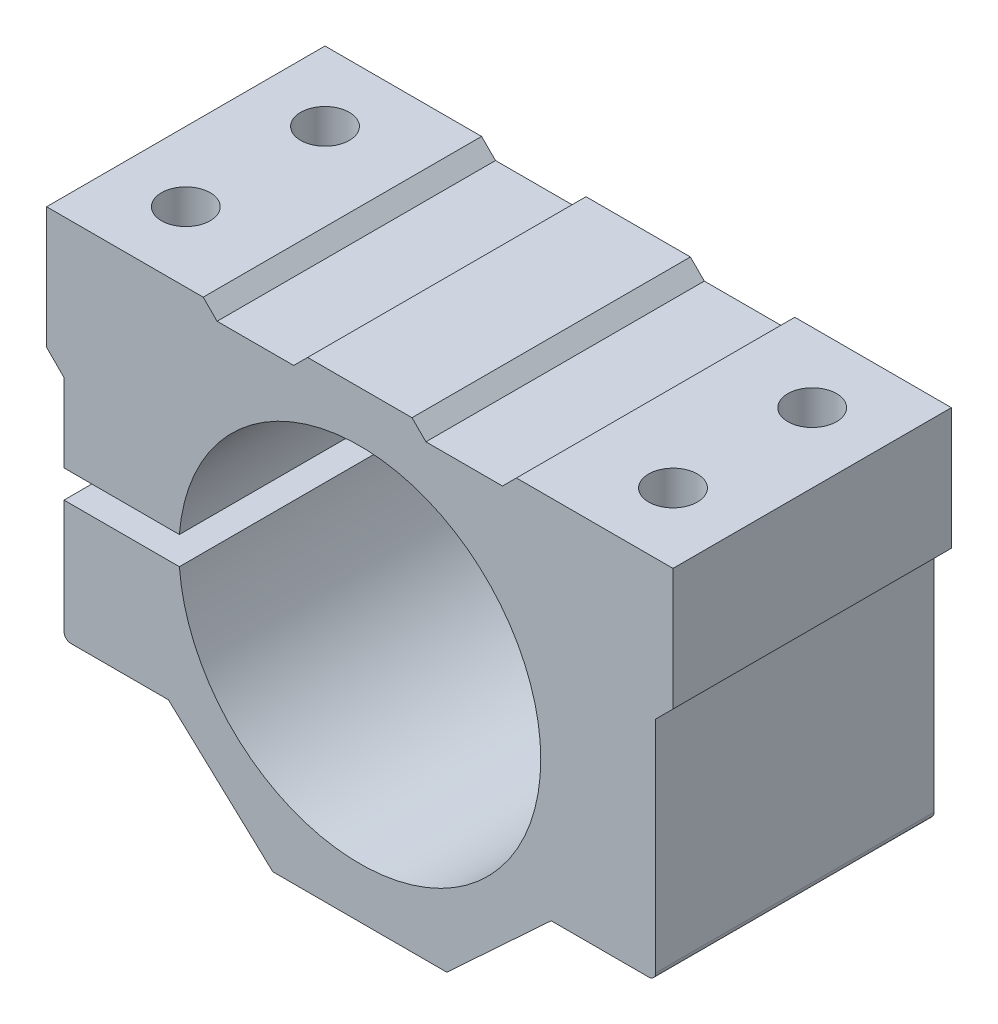
ISO-10303-21;
HEADER;
FILE_DESCRIPTION(('STEP AP214'),'2;1');
FILE_NAME('part.step','',(''),(''),'','','');
FILE_SCHEMA(('AUTOMOTIVE_DESIGN { 1 0 10303 214 1 1 1 1 }'));
ENDSEC;
DATA;
#1=APPLICATION_CONTEXT('core data for automotive mechanical design processes');
#2=APPLICATION_PROTOCOL_DEFINITION('international standard','automotive_design',2000,#1);
#3=PRODUCT_CONTEXT('',#1,'mechanical');
#4=PRODUCT('Part','Part','',(#3));
#5=PRODUCT_RELATED_PRODUCT_CATEGORY('part','',(#4));
#6=PRODUCT_DEFINITION_FORMATION('','',#4);
#7=PRODUCT_DEFINITION_CONTEXT('part definition',#1,'design');
#8=PRODUCT_DEFINITION('design','',#6,#7);
#9=PRODUCT_DEFINITION_SHAPE('','',#8);
#10=(LENGTH_UNIT() NAMED_UNIT(*) SI_UNIT(.MILLI.,.METRE.));
#11=(NAMED_UNIT(*) PLANE_ANGLE_UNIT() SI_UNIT($,.RADIAN.));
#12=(NAMED_UNIT(*) SI_UNIT($,.STERADIAN.) SOLID_ANGLE_UNIT());
#13=UNCERTAINTY_MEASURE_WITH_UNIT(LENGTH_MEASURE(1.E-05),#10,'distance_accuracy_value','');
#14=(GEOMETRIC_REPRESENTATION_CONTEXT(3) GLOBAL_UNCERTAINTY_ASSIGNED_CONTEXT((#13)) GLOBAL_UNIT_ASSIGNED_CONTEXT((#10,
#11,#12)) REPRESENTATION_CONTEXT('',''));
#15=CARTESIAN_POINT('',(0.,0.,0.));
#16=DIRECTION('',(0.,0.,1.));
#17=DIRECTION('',(1.,0.,0.));
#18=AXIS2_PLACEMENT_3D('',#15,#16,#17);
#19=CARTESIAN_POINT('',(0.,0.,40.));
#20=DIRECTION('',(0.,0.,-1.));
#21=DIRECTION('',(-1.,0.,0.));
#22=AXIS2_PLACEMENT_3D('',#19,#20,#21);
#23=PLANE('',#22);
#24=DIRECTION('',(1.,0.,0.));
#25=VECTOR('',#24,1.);
#26=CARTESIAN_POINT('',(42.5,-19.35,40.));
#27=LINE('',#26,#25);
#28=CARTESIAN_POINT('',(27.5,-19.35,40.));
#29=VERTEX_POINT('',#28);
#30=CARTESIAN_POINT('',(41.5,-19.35,40.));
#31=VERTEX_POINT('',#30);
#32=EDGE_CURVE('E381',#29,#31,#27,.T.);
#33=ORIENTED_EDGE('',*,*,#32,.T.);
#34=CARTESIAN_POINT('',(41.5,-18.35,40.));
#35=DIRECTION('',(0.,0.,-1.));
#36=DIRECTION('',(-1.,0.,0.));
#37=AXIS2_PLACEMENT_3D('',#34,#35,#36);
#38=CIRCLE('',#37,1.);
#39=CARTESIAN_POINT('',(42.5,-18.35,40.));
#40=VERTEX_POINT('',#39);
#41=EDGE_CURVE('E355',#31,#40,#38,.F.);
#42=ORIENTED_EDGE('',*,*,#41,.T.);
#43=DIRECTION('',(0.,1.,0.));
#44=VECTOR('',#43,1.);
#45=CARTESIAN_POINT('',(42.5,13.25,40.));
#46=LINE('',#45,#44);
#47=CARTESIAN_POINT('',(42.5,13.25,40.));
#48=VERTEX_POINT('',#47);
#49=EDGE_CURVE('E388',#40,#48,#46,.T.);
#50=ORIENTED_EDGE('',*,*,#49,.T.);
#51=DIRECTION('',(0.70710678118655,0.707106781186545,0.));
#52=VECTOR('',#51,1.);
#53=CARTESIAN_POINT('',(45.,15.75,40.));
#54=LINE('',#53,#52);
#55=CARTESIAN_POINT('',(45.,15.75,40.));
#56=VERTEX_POINT('',#55);
#57=EDGE_CURVE('E390',#48,#56,#54,.T.);
#58=ORIENTED_EDGE('',*,*,#57,.T.);
#59=DIRECTION('',(0.,1.,0.));
#60=VECTOR('',#59,1.);
#61=CARTESIAN_POINT('',(45.,33.25,40.));
#62=LINE('',#61,#60);
#63=CARTESIAN_POINT('',(45.,33.25,40.));
#64=VERTEX_POINT('',#63);
#65=EDGE_CURVE('E392',#56,#64,#62,.T.);
#66=ORIENTED_EDGE('',*,*,#65,.T.);
#67=DIRECTION('',(-1.,0.,0.));
#68=VECTOR('',#67,1.);
#69=CARTESIAN_POINT('',(45.,33.25,40.));
#70=LINE('',#69,#68);
#71=CARTESIAN_POINT('',(22.5,33.25,40.));
#72=VERTEX_POINT('',#71);
#73=EDGE_CURVE('E394',#64,#72,#70,.T.);
#74=ORIENTED_EDGE('',*,*,#73,.T.);
#75=DIRECTION('',(-0.707106781186549,-0.707106781186546,0.));
#76=VECTOR('',#75,1.);
#77=CARTESIAN_POINT('',(22.5,33.25,40.));
#78=LINE('',#77,#76);
#79=CARTESIAN_POINT('',(20.5,31.25,40.));
#80=VERTEX_POINT('',#79);
#81=EDGE_CURVE('E396',#72,#80,#78,.T.);
#82=ORIENTED_EDGE('',*,*,#81,.T.);
#83=DIRECTION('',(-1.,0.,0.));
#84=VECTOR('',#83,1.);
#85=CARTESIAN_POINT('',(20.5,31.25,40.));
#86=LINE('',#85,#84);
#87=CARTESIAN_POINT('',(9.49999999999999,31.25,40.));
#88=VERTEX_POINT('',#87);
#89=EDGE_CURVE('E398',#80,#88,#86,.T.);
#90=ORIENTED_EDGE('',*,*,#89,.T.);
#91=DIRECTION('',(-0.707106781186546,0.707106781186549,0.));
#92=VECTOR('',#91,1.);
#93=CARTESIAN_POINT('',(9.49999999999999,31.25,40.));
#94=LINE('',#93,#92);
#95=CARTESIAN_POINT('',(7.5,33.25,40.));
#96=VERTEX_POINT('',#95);
#97=EDGE_CURVE('E400',#88,#96,#94,.T.);
#98=ORIENTED_EDGE('',*,*,#97,.T.);
#99=DIRECTION('',(-1.,0.,0.));
#100=VECTOR('',#99,1.);
#101=CARTESIAN_POINT('',(-7.5,33.25,40.));
#102=LINE('',#101,#100);
#103=CARTESIAN_POINT('',(-7.5,33.25,40.));
#104=VERTEX_POINT('',#103);
#105=EDGE_CURVE('E402',#96,#104,#102,.T.);
#106=ORIENTED_EDGE('',*,*,#105,.T.);
#107=DIRECTION('',(-0.707106781186546,-0.707106781186549,0.));
#108=VECTOR('',#107,1.);
#109=CARTESIAN_POINT('',(-9.49999999999999,31.25,40.));
#110=LINE('',#109,#108);
#111=CARTESIAN_POINT('',(-9.49999999999999,31.25,40.));
#112=VERTEX_POINT('',#111);
#113=EDGE_CURVE('E404',#104,#112,#110,.T.);
#114=ORIENTED_EDGE('',*,*,#113,.T.);
#115=DIRECTION('',(-1.,0.,0.));
#116=VECTOR('',#115,1.);
#117=CARTESIAN_POINT('',(-20.5,31.25,40.));
#118=LINE('',#117,#116);
#119=CARTESIAN_POINT('',(-20.5,31.25,40.));
#120=VERTEX_POINT('',#119);
#121=EDGE_CURVE('E406',#112,#120,#118,.T.);
#122=ORIENTED_EDGE('',*,*,#121,.T.);
#123=DIRECTION('',(-0.707106781186549,0.707106781186546,0.));
#124=VECTOR('',#123,1.);
#125=CARTESIAN_POINT('',(-22.5,33.25,40.));
#126=LINE('',#125,#124);
#127=CARTESIAN_POINT('',(-22.5,33.25,40.));
#128=VERTEX_POINT('',#127);
#129=EDGE_CURVE('E281',#120,#128,#126,.T.);
#130=ORIENTED_EDGE('',*,*,#129,.T.);
#131=DIRECTION('',(-1.,0.,0.));
#132=VECTOR('',#131,1.);
#133=CARTESIAN_POINT('',(-45.,33.25,40.));
#134=LINE('',#133,#132);
#135=CARTESIAN_POINT('',(-45.,33.25,40.));
#136=VERTEX_POINT('',#135);
#137=EDGE_CURVE('E276',#128,#136,#134,.T.);
#138=ORIENTED_EDGE('',*,*,#137,.T.);
#139=DIRECTION('',(0.,-1.,0.));
#140=VECTOR('',#139,1.);
#141=CARTESIAN_POINT('',(-45.,33.25,40.));
#142=LINE('',#141,#140);
#143=CARTESIAN_POINT('',(-45.,15.75,40.));
#144=VERTEX_POINT('',#143);
#145=EDGE_CURVE('E422',#136,#144,#142,.T.);
#146=ORIENTED_EDGE('',*,*,#145,.T.);
#147=DIRECTION('',(0.70710678118655,-0.707106781186545,0.));
#148=VECTOR('',#147,1.);
#149=CARTESIAN_POINT('',(-45.,15.75,40.));
#150=LINE('',#149,#148);
#151=CARTESIAN_POINT('',(-42.5,13.25,40.));
#152=VERTEX_POINT('',#151);
#153=EDGE_CURVE('E796',#144,#152,#150,.T.);
#154=ORIENTED_EDGE('',*,*,#153,.T.);
#155=DIRECTION('',(0.,-1.,0.));
#156=VECTOR('',#155,1.);
#157=CARTESIAN_POINT('',(-42.5,13.25,40.));
#158=LINE('',#157,#156);
#159=CARTESIAN_POINT('',(-42.5,2.,40.));
#160=VERTEX_POINT('',#159);
#161=EDGE_CURVE('E799',#152,#160,#158,.T.);
#162=ORIENTED_EDGE('',*,*,#161,.T.);
#163=DIRECTION('',(-1.,0.,0.));
#164=VECTOR('',#163,1.);
#165=CARTESIAN_POINT('',(-48.6147155122932,2.,40.));
#166=LINE('',#165,#164);
#167=CARTESIAN_POINT('',(-25.9229627936314,2.,40.));
#168=VERTEX_POINT('',#167);
#169=EDGE_CURVE('E212',#168,#160,#166,.T.);
#170=ORIENTED_EDGE('',*,*,#169,.F.);
#171=CARTESIAN_POINT('',(0.,0.,40.));
#172=DIRECTION('',(0.,0.,1.));
#173=DIRECTION('',(1.,0.,0.));
#174=AXIS2_PLACEMENT_3D('',#171,#172,#173);
#175=CIRCLE('',#174,26.);
#176=CARTESIAN_POINT('',(-25.9229627936314,-2.,40.));
#177=VERTEX_POINT('',#176);
#178=EDGE_CURVE('E412',#177,#168,#175,.T.);
#179=ORIENTED_EDGE('',*,*,#178,.F.);
#180=DIRECTION('',(1.,0.,0.));
#181=VECTOR('',#180,1.);
#182=CARTESIAN_POINT('',(-48.6147155122932,-2.,40.));
#183=LINE('',#182,#181);
#184=CARTESIAN_POINT('',(-42.5,-2.,40.));
#185=VERTEX_POINT('',#184);
#186=EDGE_CURVE('E230',#185,#177,#183,.T.);
#187=ORIENTED_EDGE('',*,*,#186,.F.);
#188=CARTESIAN_POINT('',(-42.5,-18.35,40.));
#189=VERTEX_POINT('',#188);
#190=EDGE_CURVE('E798',#185,#189,#158,.T.);
#191=ORIENTED_EDGE('',*,*,#190,.T.);
#192=CARTESIAN_POINT('',(-41.5,-18.35,40.));
#193=DIRECTION('',(0.,0.,-1.));
#194=DIRECTION('',(-1.,0.,0.));
#195=AXIS2_PLACEMENT_3D('',#192,#193,#194);
#196=CIRCLE('',#195,1.);
#197=CARTESIAN_POINT('',(-41.5,-19.35,40.));
#198=VERTEX_POINT('',#197);
#199=EDGE_CURVE('E49',#189,#198,#196,.F.);
#200=ORIENTED_EDGE('',*,*,#199,.T.);
#201=DIRECTION('',(1.,0.,0.));
#202=VECTOR('',#201,1.);
#203=CARTESIAN_POINT('',(-42.5,-19.35,40.));
#204=LINE('',#203,#202);
#205=CARTESIAN_POINT('',(-27.5,-19.35,40.));
#206=VERTEX_POINT('',#205);
#207=EDGE_CURVE('E362',#198,#206,#204,.T.);
#208=ORIENTED_EDGE('',*,*,#207,.T.);
#209=DIRECTION('',(0.733489755383455,-0.679700506655336,0.));
#210=VECTOR('',#209,1.);
#211=CARTESIAN_POINT('',(-27.5,-19.35,40.));
#212=LINE('',#211,#210);
#213=CARTESIAN_POINT('',(-12.5,-33.25,40.));
#214=VERTEX_POINT('',#213);
#215=EDGE_CURVE('E379',#206,#214,#212,.T.);
#216=ORIENTED_EDGE('',*,*,#215,.T.);
#217=DIRECTION('',(1.,0.,0.));
#218=VECTOR('',#217,1.);
#219=CARTESIAN_POINT('',(-12.5,-33.25,40.));
#220=LINE('',#219,#218);
#221=CARTESIAN_POINT('',(12.5,-33.25,40.));
#222=VERTEX_POINT('',#221);
#223=EDGE_CURVE('E376',#214,#222,#220,.T.);
#224=ORIENTED_EDGE('',*,*,#223,.T.);
#225=DIRECTION('',(0.733489755383455,0.679700506655336,0.));
#226=VECTOR('',#225,1.);
#227=CARTESIAN_POINT('',(27.5,-19.35,40.));
#228=LINE('',#227,#226);
#229=EDGE_CURVE('E378',#222,#29,#228,.T.);
#230=ORIENTED_EDGE('',*,*,#229,.T.);
#231=EDGE_LOOP('',(#33,#42,#50,#58,#66,#74,#82,#90,#98,#106,#114,#122,#130,#138,#146,#154,#162,
#170,#179,#187,#191,#200,#208,#216,#224,#230));
#232=FACE_BOUND('',#231,.T.);
#233=ADVANCED_FACE('F34',(#232),#23,.F.);
#234=CARTESIAN_POINT('',(0.,0.,0.));
#235=DIRECTION('',(0.,0.,-1.));
#236=DIRECTION('',(-1.,0.,0.));
#237=AXIS2_PLACEMENT_3D('',#234,#235,#236);
#238=PLANE('',#237);
#239=DIRECTION('',(0.,1.,0.));
#240=VECTOR('',#239,1.);
#241=CARTESIAN_POINT('',(42.5,13.25,0.));
#242=LINE('',#241,#240);
#243=CARTESIAN_POINT('',(42.5,-18.35,0.));
#244=VERTEX_POINT('',#243);
#245=CARTESIAN_POINT('',(42.5,13.25,0.));
#246=VERTEX_POINT('',#245);
#247=EDGE_CURVE('E254',#244,#246,#242,.T.);
#248=ORIENTED_EDGE('',*,*,#247,.F.);
#249=CARTESIAN_POINT('',(41.5,-18.35,0.));
#250=DIRECTION('',(0.,0.,-1.));
#251=DIRECTION('',(-1.,0.,0.));
#252=AXIS2_PLACEMENT_3D('',#249,#250,#251);
#253=CIRCLE('',#252,1.);
#254=CARTESIAN_POINT('',(41.5,-19.35,0.));
#255=VERTEX_POINT('',#254);
#256=EDGE_CURVE('E350',#244,#255,#253,.T.);
#257=ORIENTED_EDGE('',*,*,#256,.T.);
#258=DIRECTION('',(1.,0.,0.));
#259=VECTOR('',#258,1.);
#260=CARTESIAN_POINT('',(42.5,-19.35,0.));
#261=LINE('',#260,#259);
#262=CARTESIAN_POINT('',(27.5,-19.35,0.));
#263=VERTEX_POINT('',#262);
#264=EDGE_CURVE('E251',#263,#255,#261,.T.);
#265=ORIENTED_EDGE('',*,*,#264,.F.);
#266=DIRECTION('',(0.733489755383455,0.679700506655336,0.));
#267=VECTOR('',#266,1.);
#268=CARTESIAN_POINT('',(27.5,-19.35,0.));
#269=LINE('',#268,#267);
#270=CARTESIAN_POINT('',(12.5,-33.25,0.));
#271=VERTEX_POINT('',#270);
#272=EDGE_CURVE('E249',#271,#263,#269,.T.);
#273=ORIENTED_EDGE('',*,*,#272,.F.);
#274=DIRECTION('',(1.,0.,0.));
#275=VECTOR('',#274,1.);
#276=CARTESIAN_POINT('',(-12.5,-33.25,0.));
#277=LINE('',#276,#275);
#278=CARTESIAN_POINT('',(-12.5,-33.25,0.));
#279=VERTEX_POINT('',#278);
#280=EDGE_CURVE('E247',#279,#271,#277,.T.);
#281=ORIENTED_EDGE('',*,*,#280,.F.);
#282=DIRECTION('',(0.733489755383455,-0.679700506655336,0.));
#283=VECTOR('',#282,1.);
#284=CARTESIAN_POINT('',(-27.5,-19.35,0.));
#285=LINE('',#284,#283);
#286=CARTESIAN_POINT('',(-27.5,-19.35,0.));
#287=VERTEX_POINT('',#286);
#288=EDGE_CURVE('E240',#287,#279,#285,.T.);
#289=ORIENTED_EDGE('',*,*,#288,.F.);
#290=DIRECTION('',(1.,0.,0.));
#291=VECTOR('',#290,1.);
#292=CARTESIAN_POINT('',(-42.5,-19.35,0.));
#293=LINE('',#292,#291);
#294=CARTESIAN_POINT('',(-41.5,-19.35,0.));
#295=VERTEX_POINT('',#294);
#296=EDGE_CURVE('E237',#295,#287,#293,.T.);
#297=ORIENTED_EDGE('',*,*,#296,.F.);
#298=CARTESIAN_POINT('',(-41.5,-18.35,0.));
#299=DIRECTION('',(0.,0.,-1.));
#300=DIRECTION('',(-1.,0.,0.));
#301=AXIS2_PLACEMENT_3D('',#298,#299,#300);
#302=CIRCLE('',#301,1.);
#303=CARTESIAN_POINT('',(-42.5,-18.35,0.));
#304=VERTEX_POINT('',#303);
#305=EDGE_CURVE('E348',#295,#304,#302,.T.);
#306=ORIENTED_EDGE('',*,*,#305,.T.);
#307=DIRECTION('',(0.,-1.,0.));
#308=VECTOR('',#307,1.);
#309=CARTESIAN_POINT('',(-42.5,13.25,0.));
#310=LINE('',#309,#308);
#311=CARTESIAN_POINT('',(-42.5,-2.,0.));
#312=VERTEX_POINT('',#311);
#313=EDGE_CURVE('E238',#312,#304,#310,.T.);
#314=ORIENTED_EDGE('',*,*,#313,.F.);
#315=DIRECTION('',(1.,0.,0.));
#316=VECTOR('',#315,1.);
#317=CARTESIAN_POINT('',(-48.6147155122932,-2.,0.));
#318=LINE('',#317,#316);
#319=CARTESIAN_POINT('',(-25.9229627936314,-2.,0.));
#320=VERTEX_POINT('',#319);
#321=EDGE_CURVE('E231',#312,#320,#318,.T.);
#322=ORIENTED_EDGE('',*,*,#321,.T.);
#323=CARTESIAN_POINT('',(0.,0.,0.));
#324=DIRECTION('',(0.,0.,1.));
#325=DIRECTION('',(1.,0.,0.));
#326=AXIS2_PLACEMENT_3D('',#323,#324,#325);
#327=CIRCLE('',#326,26.);
#328=CARTESIAN_POINT('',(-25.9229627936314,2.,0.));
#329=VERTEX_POINT('',#328);
#330=EDGE_CURVE('E229',#320,#329,#327,.T.);
#331=ORIENTED_EDGE('',*,*,#330,.T.);
#332=DIRECTION('',(-1.,0.,0.));
#333=VECTOR('',#332,1.);
#334=CARTESIAN_POINT('',(-48.6147155122932,2.,0.));
#335=LINE('',#334,#333);
#336=CARTESIAN_POINT('',(-42.5,2.,0.));
#337=VERTEX_POINT('',#336);
#338=EDGE_CURVE('E209',#329,#337,#335,.T.);
#339=ORIENTED_EDGE('',*,*,#338,.T.);
#340=CARTESIAN_POINT('',(-42.5,13.25,0.));
#341=VERTEX_POINT('',#340);
#342=EDGE_CURVE('E226',#341,#337,#310,.T.);
#343=ORIENTED_EDGE('',*,*,#342,.F.);
#344=DIRECTION('',(0.70710678118655,-0.707106781186545,0.));
#345=VECTOR('',#344,1.);
#346=CARTESIAN_POINT('',(-45.,15.75,0.));
#347=LINE('',#346,#345);
#348=CARTESIAN_POINT('',(-45.,15.75,0.));
#349=VERTEX_POINT('',#348);
#350=EDGE_CURVE('E242',#349,#341,#347,.T.);
#351=ORIENTED_EDGE('',*,*,#350,.F.);
#352=DIRECTION('',(0.,-1.,0.));
#353=VECTOR('',#352,1.);
#354=CARTESIAN_POINT('',(-45.,33.25,0.));
#355=LINE('',#354,#353);
#356=CARTESIAN_POINT('',(-45.,33.25,0.));
#357=VERTEX_POINT('',#356);
#358=EDGE_CURVE('E411',#357,#349,#355,.T.);
#359=ORIENTED_EDGE('',*,*,#358,.F.);
#360=DIRECTION('',(-1.,0.,0.));
#361=VECTOR('',#360,1.);
#362=CARTESIAN_POINT('',(-45.,33.25,0.));
#363=LINE('',#362,#361);
#364=CARTESIAN_POINT('',(-22.5,33.25,0.));
#365=VERTEX_POINT('',#364);
#366=EDGE_CURVE('E409',#365,#357,#363,.T.);
#367=ORIENTED_EDGE('',*,*,#366,.F.);
#368=DIRECTION('',(-0.707106781186549,0.707106781186546,0.));
#369=VECTOR('',#368,1.);
#370=CARTESIAN_POINT('',(-22.5,33.25,0.));
#371=LINE('',#370,#369);
#372=CARTESIAN_POINT('',(-20.5,31.25,0.));
#373=VERTEX_POINT('',#372);
#374=EDGE_CURVE('E274',#373,#365,#371,.T.);
#375=ORIENTED_EDGE('',*,*,#374,.F.);
#376=DIRECTION('',(-1.,0.,0.));
#377=VECTOR('',#376,1.);
#378=CARTESIAN_POINT('',(-20.5,31.25,0.));
#379=LINE('',#378,#377);
#380=CARTESIAN_POINT('',(-9.49999999999999,31.25,0.));
#381=VERTEX_POINT('',#380);
#382=EDGE_CURVE('E272',#381,#373,#379,.T.);
#383=ORIENTED_EDGE('',*,*,#382,.F.);
#384=DIRECTION('',(-0.707106781186546,-0.707106781186549,0.));
#385=VECTOR('',#384,1.);
#386=CARTESIAN_POINT('',(-9.49999999999999,31.25,0.));
#387=LINE('',#386,#385);
#388=CARTESIAN_POINT('',(-7.5,33.25,0.));
#389=VERTEX_POINT('',#388);
#390=EDGE_CURVE('E270',#389,#381,#387,.T.);
#391=ORIENTED_EDGE('',*,*,#390,.F.);
#392=DIRECTION('',(-1.,0.,0.));
#393=VECTOR('',#392,1.);
#394=CARTESIAN_POINT('',(-7.5,33.25,0.));
#395=LINE('',#394,#393);
#396=CARTESIAN_POINT('',(7.5,33.25,0.));
#397=VERTEX_POINT('',#396);
#398=EDGE_CURVE('E268',#397,#389,#395,.T.);
#399=ORIENTED_EDGE('',*,*,#398,.F.);
#400=DIRECTION('',(-0.707106781186546,0.707106781186549,0.));
#401=VECTOR('',#400,1.);
#402=CARTESIAN_POINT('',(9.49999999999999,31.25,0.));
#403=LINE('',#402,#401);
#404=CARTESIAN_POINT('',(9.49999999999999,31.25,0.));
#405=VERTEX_POINT('',#404);
#406=EDGE_CURVE('E266',#405,#397,#403,.T.);
#407=ORIENTED_EDGE('',*,*,#406,.F.);
#408=DIRECTION('',(-1.,0.,0.));
#409=VECTOR('',#408,1.);
#410=CARTESIAN_POINT('',(20.5,31.25,0.));
#411=LINE('',#410,#409);
#412=CARTESIAN_POINT('',(20.5,31.25,0.));
#413=VERTEX_POINT('',#412);
#414=EDGE_CURVE('E264',#413,#405,#411,.T.);
#415=ORIENTED_EDGE('',*,*,#414,.F.);
#416=DIRECTION('',(-0.707106781186549,-0.707106781186546,0.));
#417=VECTOR('',#416,1.);
#418=CARTESIAN_POINT('',(22.5,33.25,0.));
#419=LINE('',#418,#417);
#420=CARTESIAN_POINT('',(22.5,33.25,0.));
#421=VERTEX_POINT('',#420);
#422=EDGE_CURVE('E262',#421,#413,#419,.T.);
#423=ORIENTED_EDGE('',*,*,#422,.F.);
#424=DIRECTION('',(-1.,0.,0.));
#425=VECTOR('',#424,1.);
#426=CARTESIAN_POINT('',(45.,33.25,0.));
#427=LINE('',#426,#425);
#428=CARTESIAN_POINT('',(45.,33.25,0.));
#429=VERTEX_POINT('',#428);
#430=EDGE_CURVE('E260',#429,#421,#427,.T.);
#431=ORIENTED_EDGE('',*,*,#430,.F.);
#432=DIRECTION('',(0.,1.,0.));
#433=VECTOR('',#432,1.);
#434=CARTESIAN_POINT('',(45.,33.25,0.));
#435=LINE('',#434,#433);
#436=CARTESIAN_POINT('',(45.,15.75,0.));
#437=VERTEX_POINT('',#436);
#438=EDGE_CURVE('E258',#437,#429,#435,.T.);
#439=ORIENTED_EDGE('',*,*,#438,.F.);
#440=DIRECTION('',(0.70710678118655,0.707106781186545,0.));
#441=VECTOR('',#440,1.);
#442=CARTESIAN_POINT('',(45.,15.75,0.));
#443=LINE('',#442,#441);
#444=EDGE_CURVE('E256',#246,#437,#443,.T.);
#445=ORIENTED_EDGE('',*,*,#444,.F.);
#446=EDGE_LOOP('',(#248,#257,#265,#273,#281,#289,#297,#306,#314,#322,#331,#339,#343,#351,#359,
#367,#375,#383,#391,#399,#407,#415,#423,#431,#439,#445));
#447=FACE_BOUND('',#446,.T.);
#448=ADVANCED_FACE('F224',(#447),#238,.T.);
#449=CARTESIAN_POINT('',(-42.5,13.25,40.));
#450=DIRECTION('',(1.,0.,0.));
#451=DIRECTION('',(0.,1.,0.));
#452=AXIS2_PLACEMENT_3D('',#449,#450,#451);
#453=PLANE('',#452);
#454=ORIENTED_EDGE('',*,*,#313,.T.);
#455=DIRECTION('',(0.,0.,-1.));
#456=VECTOR('',#455,1.);
#457=CARTESIAN_POINT('',(-42.5,-18.35,40.));
#458=LINE('',#457,#456);
#459=EDGE_CURVE('E11',#304,#189,#458,.F.);
#460=ORIENTED_EDGE('',*,*,#459,.T.);
#461=ORIENTED_EDGE('',*,*,#190,.F.);
#462=DIRECTION('',(0.,0.,1.));
#463=VECTOR('',#462,1.);
#464=CARTESIAN_POINT('',(-42.5,-2.,40.));
#465=LINE('',#464,#463);
#466=EDGE_CURVE('E803',#312,#185,#465,.T.);
#467=ORIENTED_EDGE('',*,*,#466,.F.);
#468=EDGE_LOOP('',(#454,#460,#461,#467));
#469=FACE_BOUND('',#468,.T.);
#470=ADVANCED_FACE('F506',(#469),#453,.F.);
#471=DIRECTION('',(0.,0.,-1.));
#472=VECTOR('',#471,1.);
#473=CARTESIAN_POINT('',(-42.5,2.,40.));
#474=LINE('',#473,#472);
#475=EDGE_CURVE('E206',#160,#337,#474,.T.);
#476=ORIENTED_EDGE('',*,*,#475,.F.);
#477=ORIENTED_EDGE('',*,*,#161,.F.);
#478=DIRECTION('',(0.,0.,-1.));
#479=VECTOR('',#478,1.);
#480=CARTESIAN_POINT('',(-42.5,13.25,40.));
#481=LINE('',#480,#479);
#482=EDGE_CURVE('E236',#152,#341,#481,.T.);
#483=ORIENTED_EDGE('',*,*,#482,.T.);
#484=ORIENTED_EDGE('',*,*,#342,.T.);
#485=EDGE_LOOP('',(#476,#477,#483,#484));
#486=FACE_BOUND('',#485,.T.);
#487=ADVANCED_FACE('F234',(#486),#453,.F.);
#488=CARTESIAN_POINT('',(0.,0.,40.));
#489=DIRECTION('',(0.,0.,-1.));
#490=DIRECTION('',(-1.,0.,0.));
#491=AXIS2_PLACEMENT_3D('',#488,#489,#490);
#492=CYLINDRICAL_SURFACE('',#491,26.);
#493=ORIENTED_EDGE('',*,*,#330,.F.);
#494=DIRECTION('',(0.,0.,-1.));
#495=VECTOR('',#494,1.);
#496=CARTESIAN_POINT('',(-25.9229627936314,-2.,40.));
#497=LINE('',#496,#495);
#498=EDGE_CURVE('E806',#320,#177,#497,.F.);
#499=ORIENTED_EDGE('',*,*,#498,.T.);
#500=ORIENTED_EDGE('',*,*,#178,.T.);
#501=DIRECTION('',(0.,0.,-1.));
#502=VECTOR('',#501,1.);
#503=CARTESIAN_POINT('',(-25.9229627936314,2.,40.));
#504=LINE('',#503,#502);
#505=EDGE_CURVE('E218',#168,#329,#504,.T.);
#506=ORIENTED_EDGE('',*,*,#505,.T.);
#507=EDGE_LOOP('',(#493,#499,#500,#506));
#508=FACE_BOUND('',#507,.T.);
#509=ADVANCED_FACE('F509',(#508),#492,.F.);
#510=CARTESIAN_POINT('',(-35.,-33.25,10.));
#511=DIRECTION('',(0.,1.,0.));
#512=DIRECTION('',(0.,0.,1.));
#513=AXIS2_PLACEMENT_3D('',#510,#511,#512);
#514=CYLINDRICAL_SURFACE('',#513,3.5);
#515=CARTESIAN_POINT('',(-35.,-19.35,10.));
#516=DIRECTION('',(0.,1.,0.));
#517=DIRECTION('',(-1.,0.,0.));
#518=AXIS2_PLACEMENT_3D('',#515,#516,#517);
#519=CIRCLE('',#518,3.5);
#520=CARTESIAN_POINT('',(-38.5,-19.35,10.));
#521=VERTEX_POINT('',#520);
#522=EDGE_CURVE('E331',#521,#521,#519,.T.);
#523=ORIENTED_EDGE('',*,*,#522,.F.);
#524=EDGE_LOOP('',(#523));
#525=FACE_BOUND('',#524,.T.);
#526=CARTESIAN_POINT('',(-35.,-2.,10.));
#527=DIRECTION('',(0.,1.,0.));
#528=DIRECTION('',(-1.,0.,0.));
#529=AXIS2_PLACEMENT_3D('',#526,#527,#528);
#530=CIRCLE('',#529,3.5);
#531=CARTESIAN_POINT('',(-38.5,-2.,10.));
#532=VERTEX_POINT('',#531);
#533=EDGE_CURVE('E345',#532,#532,#530,.F.);
#534=ORIENTED_EDGE('',*,*,#533,.F.);
#535=EDGE_LOOP('',(#534));
#536=FACE_BOUND('',#535,.T.);
#537=ADVANCED_FACE('F660',(#525,#536),#514,.F.);
#538=CARTESIAN_POINT('',(-35.,33.25,10.));
#539=DIRECTION('',(0.,1.,0.));
#540=DIRECTION('',(0.,0.,1.));
#541=AXIS2_PLACEMENT_3D('',#538,#539,#540);
#542=CIRCLE('',#541,3.5);
#543=CARTESIAN_POINT('',(-35.,33.25,13.5));
#544=VERTEX_POINT('',#543);
#545=EDGE_CURVE('E334',#544,#544,#542,.T.);
#546=ORIENTED_EDGE('',*,*,#545,.T.);
#547=EDGE_LOOP('',(#546));
#548=FACE_BOUND('',#547,.T.);
#549=CARTESIAN_POINT('',(-35.,2.,10.));
#550=DIRECTION('',(0.,-1.,0.));
#551=DIRECTION('',(0.,0.,-1.));
#552=AXIS2_PLACEMENT_3D('',#549,#550,#551);
#553=CIRCLE('',#552,3.5);
#554=CARTESIAN_POINT('',(-35.,2.,6.5));
#555=VERTEX_POINT('',#554);
#556=EDGE_CURVE('E342',#555,#555,#553,.F.);
#557=ORIENTED_EDGE('',*,*,#556,.F.);
#558=EDGE_LOOP('',(#557));
#559=FACE_BOUND('',#558,.T.);
#560=ADVANCED_FACE('F668',(#548,#559),#514,.F.);
#561=CARTESIAN_POINT('',(-35.,-33.25,30.));
#562=DIRECTION('',(0.,1.,0.));
#563=DIRECTION('',(0.,0.,1.));
#564=AXIS2_PLACEMENT_3D('',#561,#562,#563);
#565=CYLINDRICAL_SURFACE('',#564,3.5);
#566=CARTESIAN_POINT('',(-35.,-19.35,30.));
#567=DIRECTION('',(0.,1.,0.));
#568=DIRECTION('',(-1.,0.,0.));
#569=AXIS2_PLACEMENT_3D('',#566,#567,#568);
#570=CIRCLE('',#569,3.5);
#571=CARTESIAN_POINT('',(-38.5,-19.35,30.));
#572=VERTEX_POINT('',#571);
#573=EDGE_CURVE('E335',#572,#572,#570,.T.);
#574=ORIENTED_EDGE('',*,*,#573,.F.);
#575=EDGE_LOOP('',(#574));
#576=FACE_BOUND('',#575,.T.);
#577=CARTESIAN_POINT('',(-35.,-2.,30.));
#578=DIRECTION('',(0.,1.,0.));
#579=DIRECTION('',(-1.,0.,0.));
#580=AXIS2_PLACEMENT_3D('',#577,#578,#579);
#581=CIRCLE('',#580,3.5);
#582=CARTESIAN_POINT('',(-38.5,-2.,30.));
#583=VERTEX_POINT('',#582);
#584=EDGE_CURVE('E217',#583,#583,#581,.F.);
#585=ORIENTED_EDGE('',*,*,#584,.F.);
#586=EDGE_LOOP('',(#585));
#587=FACE_BOUND('',#586,.T.);
#588=ADVANCED_FACE('F676',(#576,#587),#565,.F.);
#589=CARTESIAN_POINT('',(-35.,33.25,30.));
#590=DIRECTION('',(0.,1.,0.));
#591=DIRECTION('',(0.,0.,-1.));
#592=AXIS2_PLACEMENT_3D('',#589,#590,#591);
#593=CIRCLE('',#592,3.5);
#594=CARTESIAN_POINT('',(-35.,33.25,26.5));
#595=VERTEX_POINT('',#594);
#596=EDGE_CURVE('E784',#595,#595,#593,.T.);
#597=ORIENTED_EDGE('',*,*,#596,.T.);
#598=EDGE_LOOP('',(#597));
#599=FACE_BOUND('',#598,.T.);
#600=CARTESIAN_POINT('',(-35.,2.,30.));
#601=DIRECTION('',(0.,-1.,0.));
#602=DIRECTION('',(0.,0.,-1.));
#603=AXIS2_PLACEMENT_3D('',#600,#601,#602);
#604=CIRCLE('',#603,3.5);
#605=CARTESIAN_POINT('',(-35.,2.,26.5));
#606=VERTEX_POINT('',#605);
#607=EDGE_CURVE('E339',#606,#606,#604,.F.);
#608=ORIENTED_EDGE('',*,*,#607,.F.);
#609=EDGE_LOOP('',(#608));
#610=FACE_BOUND('',#609,.T.);
#611=ADVANCED_FACE('F684',(#599,#610),#565,.F.);
#612=CARTESIAN_POINT('',(-45.,33.25,40.));
#613=DIRECTION('',(0.,-1.,0.));
#614=DIRECTION('',(0.,0.,-1.));
#615=AXIS2_PLACEMENT_3D('',#612,#613,#614);
#616=PLANE('',#615);
#617=ORIENTED_EDGE('',*,*,#596,.F.);
#618=EDGE_LOOP('',(#617));
#619=FACE_BOUND('',#618,.T.);
#620=ORIENTED_EDGE('',*,*,#545,.F.);
#621=EDGE_LOOP('',(#620));
#622=FACE_BOUND('',#621,.T.);
#623=ORIENTED_EDGE('',*,*,#366,.T.);
#624=DIRECTION('',(0.,0.,-1.));
#625=VECTOR('',#624,1.);
#626=CARTESIAN_POINT('',(-45.,33.25,40.));
#627=LINE('',#626,#625);
#628=EDGE_CURVE('E327',#136,#357,#627,.T.);
#629=ORIENTED_EDGE('',*,*,#628,.F.);
#630=ORIENTED_EDGE('',*,*,#137,.F.);
#631=DIRECTION('',(0.,0.,-1.));
#632=VECTOR('',#631,1.);
#633=CARTESIAN_POINT('',(-22.5,33.25,40.));
#634=LINE('',#633,#632);
#635=EDGE_CURVE('E277',#128,#365,#634,.T.);
#636=ORIENTED_EDGE('',*,*,#635,.T.);
#637=EDGE_LOOP('',(#623,#629,#630,#636));
#638=FACE_BOUND('',#637,.T.);
#639=ADVANCED_FACE('F426',(#619,#622,#638),#616,.F.);
#640=CARTESIAN_POINT('',(-45.,33.25,40.));
#641=DIRECTION('',(1.,0.,0.));
#642=DIRECTION('',(0.,1.,0.));
#643=AXIS2_PLACEMENT_3D('',#640,#641,#642);
#644=PLANE('',#643);
#645=ORIENTED_EDGE('',*,*,#358,.T.);
#646=DIRECTION('',(0.,0.,-1.));
#647=VECTOR('',#646,1.);
#648=CARTESIAN_POINT('',(-45.,15.75,40.));
#649=LINE('',#648,#647);
#650=EDGE_CURVE('E324',#144,#349,#649,.T.);
#651=ORIENTED_EDGE('',*,*,#650,.F.);
#652=ORIENTED_EDGE('',*,*,#145,.F.);
#653=ORIENTED_EDGE('',*,*,#628,.T.);
#654=EDGE_LOOP('',(#645,#651,#652,#653));
#655=FACE_BOUND('',#654,.T.);
#656=ADVANCED_FACE('F421',(#655),#644,.F.);
#657=CARTESIAN_POINT('',(-45.,15.75,40.));
#658=DIRECTION('',(0.707106781186545,0.70710678118655,0.));
#659=DIRECTION('',(-0.70710678118655,0.707106781186545,0.));
#660=AXIS2_PLACEMENT_3D('',#657,#658,#659);
#661=PLANE('',#660);
#662=ORIENTED_EDGE('',*,*,#350,.T.);
#663=ORIENTED_EDGE('',*,*,#482,.F.);
#664=ORIENTED_EDGE('',*,*,#153,.F.);
#665=ORIENTED_EDGE('',*,*,#650,.T.);
#666=EDGE_LOOP('',(#662,#663,#664,#665));
#667=FACE_BOUND('',#666,.T.);
#668=ADVANCED_FACE('F416',(#667),#661,.F.);
#669=CARTESIAN_POINT('',(-42.5,-19.35,40.));
#670=DIRECTION('',(0.,1.,0.));
#671=DIRECTION('',(-1.,0.,0.));
#672=AXIS2_PLACEMENT_3D('',#669,#670,#671);
#673=PLANE('',#672);
#674=ORIENTED_EDGE('',*,*,#573,.T.);
#675=EDGE_LOOP('',(#674));
#676=FACE_BOUND('',#675,.T.);
#677=ORIENTED_EDGE('',*,*,#522,.T.);
#678=EDGE_LOOP('',(#677));
#679=FACE_BOUND('',#678,.T.);
#680=ORIENTED_EDGE('',*,*,#207,.F.);
#681=DIRECTION('',(0.,0.,-1.));
#682=VECTOR('',#681,1.);
#683=CARTESIAN_POINT('',(-41.5,-19.35,40.));
#684=LINE('',#683,#682);
#685=EDGE_CURVE('E42',#198,#295,#684,.T.);
#686=ORIENTED_EDGE('',*,*,#685,.T.);
#687=ORIENTED_EDGE('',*,*,#296,.T.);
#688=DIRECTION('',(0.,0.,-1.));
#689=VECTOR('',#688,1.);
#690=CARTESIAN_POINT('',(-27.5,-19.35,40.));
#691=LINE('',#690,#689);
#692=EDGE_CURVE('E320',#206,#287,#691,.T.);
#693=ORIENTED_EDGE('',*,*,#692,.F.);
#694=EDGE_LOOP('',(#680,#686,#687,#693));
#695=FACE_BOUND('',#694,.T.);
#696=ADVANCED_FACE('F360',(#676,#679,#695),#673,.F.);
#697=CARTESIAN_POINT('',(-27.5,-19.35,40.));
#698=DIRECTION('',(0.679700506655336,0.733489755383455,0.));
#699=DIRECTION('',(-0.733489755383455,0.679700506655336,0.));
#700=AXIS2_PLACEMENT_3D('',#697,#698,#699);
#701=PLANE('',#700);
#702=ORIENTED_EDGE('',*,*,#288,.T.);
#703=DIRECTION('',(0.,0.,-1.));
#704=VECTOR('',#703,1.);
#705=CARTESIAN_POINT('',(-12.5,-33.25,40.));
#706=LINE('',#705,#704);
#707=EDGE_CURVE('E317',#214,#279,#706,.T.);
#708=ORIENTED_EDGE('',*,*,#707,.F.);
#709=ORIENTED_EDGE('',*,*,#215,.F.);
#710=ORIENTED_EDGE('',*,*,#692,.T.);
#711=EDGE_LOOP('',(#702,#708,#709,#710));
#712=FACE_BOUND('',#711,.T.);
#713=ADVANCED_FACE('F370',(#712),#701,.F.);
#714=CARTESIAN_POINT('',(-12.5,-33.25,40.));
#715=DIRECTION('',(0.,1.,0.));
#716=DIRECTION('',(0.,0.,1.));
#717=AXIS2_PLACEMENT_3D('',#714,#715,#716);
#718=PLANE('',#717);
#719=ORIENTED_EDGE('',*,*,#280,.T.);
#720=DIRECTION('',(0.,0.,-1.));
#721=VECTOR('',#720,1.);
#722=CARTESIAN_POINT('',(12.5,-33.25,40.));
#723=LINE('',#722,#721);
#724=EDGE_CURVE('E314',#222,#271,#723,.T.);
#725=ORIENTED_EDGE('',*,*,#724,.F.);
#726=ORIENTED_EDGE('',*,*,#223,.F.);
#727=ORIENTED_EDGE('',*,*,#707,.T.);
#728=EDGE_LOOP('',(#719,#725,#726,#727));
#729=FACE_BOUND('',#728,.T.);
#730=ADVANCED_FACE('F374',(#729),#718,.F.);
#731=CARTESIAN_POINT('',(27.5,-19.35,40.));
#732=DIRECTION('',(-0.679700506655336,0.733489755383455,0.));
#733=DIRECTION('',(-0.733489755383455,-0.679700506655336,0.));
#734=AXIS2_PLACEMENT_3D('',#731,#732,#733);
#735=PLANE('',#734);
#736=ORIENTED_EDGE('',*,*,#272,.T.);
#737=DIRECTION('',(0.,0.,-1.));
#738=VECTOR('',#737,1.);
#739=CARTESIAN_POINT('',(27.5,-19.35,40.));
#740=LINE('',#739,#738);
#741=EDGE_CURVE('E311',#29,#263,#740,.T.);
#742=ORIENTED_EDGE('',*,*,#741,.F.);
#743=ORIENTED_EDGE('',*,*,#229,.F.);
#744=ORIENTED_EDGE('',*,*,#724,.T.);
#745=EDGE_LOOP('',(#736,#742,#743,#744));
#746=FACE_BOUND('',#745,.T.);
#747=ADVANCED_FACE('F491',(#746),#735,.F.);
#748=CARTESIAN_POINT('',(42.5,-19.35,40.));
#749=DIRECTION('',(0.,1.,0.));
#750=DIRECTION('',(-1.,0.,0.));
#751=AXIS2_PLACEMENT_3D('',#748,#749,#750);
#752=PLANE('',#751);
#753=CARTESIAN_POINT('',(35.,-19.35,30.));
#754=DIRECTION('',(0.,1.,0.));
#755=DIRECTION('',(-1.,0.,0.));
#756=AXIS2_PLACEMENT_3D('',#753,#754,#755);
#757=CIRCLE('',#756,3.5);
#758=CARTESIAN_POINT('',(31.5,-19.35,30.));
#759=VERTEX_POINT('',#758);
#760=EDGE_CURVE('E338',#759,#759,#757,.T.);
#761=ORIENTED_EDGE('',*,*,#760,.T.);
#762=EDGE_LOOP('',(#761));
#763=FACE_BOUND('',#762,.T.);
#764=CARTESIAN_POINT('',(35.,-19.35,10.));
#765=DIRECTION('',(0.,1.,0.));
#766=DIRECTION('',(-1.,0.,0.));
#767=AXIS2_PLACEMENT_3D('',#764,#765,#766);
#768=CIRCLE('',#767,3.5);
#769=CARTESIAN_POINT('',(31.5,-19.35,10.));
#770=VERTEX_POINT('',#769);
#771=EDGE_CURVE('E818',#770,#770,#768,.T.);
#772=ORIENTED_EDGE('',*,*,#771,.T.);
#773=EDGE_LOOP('',(#772));
#774=FACE_BOUND('',#773,.T.);
#775=ORIENTED_EDGE('',*,*,#264,.T.);
#776=DIRECTION('',(0.,0.,-1.));
#777=VECTOR('',#776,1.);
#778=CARTESIAN_POINT('',(41.5,-19.35,40.));
#779=LINE('',#778,#777);
#780=EDGE_CURVE('E352',#255,#31,#779,.F.);
#781=ORIENTED_EDGE('',*,*,#780,.T.);
#782=ORIENTED_EDGE('',*,*,#32,.F.);
#783=ORIENTED_EDGE('',*,*,#741,.T.);
#784=EDGE_LOOP('',(#775,#781,#782,#783));
#785=FACE_BOUND('',#784,.T.);
#786=ADVANCED_FACE('F488',(#763,#774,#785),#752,.F.);
#787=CARTESIAN_POINT('',(42.5,13.25,40.));
#788=DIRECTION('',(-1.,0.,0.));
#789=DIRECTION('',(0.,-1.,0.));
#790=AXIS2_PLACEMENT_3D('',#787,#788,#789);
#791=PLANE('',#790);
#792=ORIENTED_EDGE('',*,*,#49,.F.);
#793=DIRECTION('',(0.,0.,-1.));
#794=VECTOR('',#793,1.);
#795=CARTESIAN_POINT('',(42.5,-18.35,40.));
#796=LINE('',#795,#794);
#797=EDGE_CURVE('E330',#40,#244,#796,.T.);
#798=ORIENTED_EDGE('',*,*,#797,.T.);
#799=ORIENTED_EDGE('',*,*,#247,.T.);
#800=DIRECTION('',(0.,0.,-1.));
#801=VECTOR('',#800,1.);
#802=CARTESIAN_POINT('',(42.5,13.25,40.));
#803=LINE('',#802,#801);
#804=EDGE_CURVE('E308',#48,#246,#803,.T.);
#805=ORIENTED_EDGE('',*,*,#804,.F.);
#806=EDGE_LOOP('',(#792,#798,#799,#805));
#807=FACE_BOUND('',#806,.T.);
#808=ADVANCED_FACE('F480',(#807),#791,.F.);
#809=CARTESIAN_POINT('',(45.,15.75,40.));
#810=DIRECTION('',(-0.707106781186545,0.70710678118655,0.));
#811=DIRECTION('',(-0.70710678118655,-0.707106781186545,0.));
#812=AXIS2_PLACEMENT_3D('',#809,#810,#811);
#813=PLANE('',#812);
#814=ORIENTED_EDGE('',*,*,#444,.T.);
#815=DIRECTION('',(0.,0.,-1.));
#816=VECTOR('',#815,1.);
#817=CARTESIAN_POINT('',(45.,15.75,40.));
#818=LINE('',#817,#816);
#819=EDGE_CURVE('E305',#56,#437,#818,.T.);
#820=ORIENTED_EDGE('',*,*,#819,.F.);
#821=ORIENTED_EDGE('',*,*,#57,.F.);
#822=ORIENTED_EDGE('',*,*,#804,.T.);
#823=EDGE_LOOP('',(#814,#820,#821,#822));
#824=FACE_BOUND('',#823,.T.);
#825=ADVANCED_FACE('F475',(#824),#813,.F.);
#826=CARTESIAN_POINT('',(45.,33.25,40.));
#827=DIRECTION('',(-1.,0.,0.));
#828=DIRECTION('',(0.,-1.,0.));
#829=AXIS2_PLACEMENT_3D('',#826,#827,#828);
#830=PLANE('',#829);
#831=ORIENTED_EDGE('',*,*,#438,.T.);
#832=DIRECTION('',(0.,0.,-1.));
#833=VECTOR('',#832,1.);
#834=CARTESIAN_POINT('',(45.,33.25,40.));
#835=LINE('',#834,#833);
#836=EDGE_CURVE('E302',#64,#429,#835,.T.);
#837=ORIENTED_EDGE('',*,*,#836,.F.);
#838=ORIENTED_EDGE('',*,*,#65,.F.);
#839=ORIENTED_EDGE('',*,*,#819,.T.);
#840=EDGE_LOOP('',(#831,#837,#838,#839));
#841=FACE_BOUND('',#840,.T.);
#842=ADVANCED_FACE('F471',(#841),#830,.F.);
#843=CARTESIAN_POINT('',(45.,33.25,40.));
#844=DIRECTION('',(0.,-1.,0.));
#845=DIRECTION('',(0.,0.,-1.));
#846=AXIS2_PLACEMENT_3D('',#843,#844,#845);
#847=PLANE('',#846);
#848=CARTESIAN_POINT('',(35.,33.25,30.));
#849=DIRECTION('',(0.,1.,0.));
#850=DIRECTION('',(0.,0.,1.));
#851=AXIS2_PLACEMENT_3D('',#848,#849,#850);
#852=CIRCLE('',#851,3.5);
#853=CARTESIAN_POINT('',(35.,33.25,33.5));
#854=VERTEX_POINT('',#853);
#855=EDGE_CURVE('E819',#854,#854,#852,.T.);
#856=ORIENTED_EDGE('',*,*,#855,.F.);
#857=EDGE_LOOP('',(#856));
#858=FACE_BOUND('',#857,.T.);
#859=CARTESIAN_POINT('',(35.,33.25,10.));
#860=DIRECTION('',(0.,1.,0.));
#861=DIRECTION('',(0.,0.,-1.));
#862=AXIS2_PLACEMENT_3D('',#859,#860,#861);
#863=CIRCLE('',#862,3.5);
#864=CARTESIAN_POINT('',(35.,33.25,6.5));
#865=VERTEX_POINT('',#864);
#866=EDGE_CURVE('E805',#865,#865,#863,.T.);
#867=ORIENTED_EDGE('',*,*,#866,.F.);
#868=EDGE_LOOP('',(#867));
#869=FACE_BOUND('',#868,.T.);
#870=ORIENTED_EDGE('',*,*,#430,.T.);
#871=DIRECTION('',(0.,0.,-1.));
#872=VECTOR('',#871,1.);
#873=CARTESIAN_POINT('',(22.5,33.25,40.));
#874=LINE('',#873,#872);
#875=EDGE_CURVE('E299',#72,#421,#874,.T.);
#876=ORIENTED_EDGE('',*,*,#875,.F.);
#877=ORIENTED_EDGE('',*,*,#73,.F.);
#878=ORIENTED_EDGE('',*,*,#836,.T.);
#879=EDGE_LOOP('',(#870,#876,#877,#878));
#880=FACE_BOUND('',#879,.T.);
#881=ADVANCED_FACE('F466',(#858,#869,#880),#847,.F.);
#882=CARTESIAN_POINT('',(22.5,33.25,40.));
#883=DIRECTION('',(0.707106781186546,-0.707106781186549,0.));
#884=DIRECTION('',(0.707106781186549,0.707106781186546,0.));
#885=AXIS2_PLACEMENT_3D('',#882,#883,#884);
#886=PLANE('',#885);
#887=ORIENTED_EDGE('',*,*,#422,.T.);
#888=DIRECTION('',(0.,0.,-1.));
#889=VECTOR('',#888,1.);
#890=CARTESIAN_POINT('',(20.5,31.25,40.));
#891=LINE('',#890,#889);
#892=EDGE_CURVE('E296',#80,#413,#891,.T.);
#893=ORIENTED_EDGE('',*,*,#892,.F.);
#894=ORIENTED_EDGE('',*,*,#81,.F.);
#895=ORIENTED_EDGE('',*,*,#875,.T.);
#896=EDGE_LOOP('',(#887,#893,#894,#895));
#897=FACE_BOUND('',#896,.T.);
#898=ADVANCED_FACE('F460',(#897),#886,.F.);
#899=CARTESIAN_POINT('',(20.5,31.25,40.));
#900=DIRECTION('',(0.,-1.,0.));
#901=DIRECTION('',(0.,0.,-1.));
#902=AXIS2_PLACEMENT_3D('',#899,#900,#901);
#903=PLANE('',#902);
#904=ORIENTED_EDGE('',*,*,#414,.T.);
#905=DIRECTION('',(0.,0.,-1.));
#906=VECTOR('',#905,1.);
#907=CARTESIAN_POINT('',(9.49999999999999,31.25,40.));
#908=LINE('',#907,#906);
#909=EDGE_CURVE('E293',#88,#405,#908,.T.);
#910=ORIENTED_EDGE('',*,*,#909,.F.);
#911=ORIENTED_EDGE('',*,*,#89,.F.);
#912=ORIENTED_EDGE('',*,*,#892,.T.);
#913=EDGE_LOOP('',(#904,#910,#911,#912));
#914=FACE_BOUND('',#913,.T.);
#915=ADVANCED_FACE('F456',(#914),#903,.F.);
#916=CARTESIAN_POINT('',(9.49999999999999,31.25,40.));
#917=DIRECTION('',(-0.707106781186549,-0.707106781186546,0.));
#918=DIRECTION('',(0.707106781186546,-0.707106781186549,0.));
#919=AXIS2_PLACEMENT_3D('',#916,#917,#918);
#920=PLANE('',#919);
#921=ORIENTED_EDGE('',*,*,#406,.T.);
#922=DIRECTION('',(0.,0.,-1.));
#923=VECTOR('',#922,1.);
#924=CARTESIAN_POINT('',(7.5,33.25,40.));
#925=LINE('',#924,#923);
#926=EDGE_CURVE('E290',#96,#397,#925,.T.);
#927=ORIENTED_EDGE('',*,*,#926,.F.);
#928=ORIENTED_EDGE('',*,*,#97,.F.);
#929=ORIENTED_EDGE('',*,*,#909,.T.);
#930=EDGE_LOOP('',(#921,#927,#928,#929));
#931=FACE_BOUND('',#930,.T.);
#932=ADVANCED_FACE('F451',(#931),#920,.F.);
#933=CARTESIAN_POINT('',(-7.5,33.25,40.));
#934=DIRECTION('',(0.,-1.,0.));
#935=DIRECTION('',(0.,0.,-1.));
#936=AXIS2_PLACEMENT_3D('',#933,#934,#935);
#937=PLANE('',#936);
#938=ORIENTED_EDGE('',*,*,#398,.T.);
#939=DIRECTION('',(0.,0.,-1.));
#940=VECTOR('',#939,1.);
#941=CARTESIAN_POINT('',(-7.5,33.25,40.));
#942=LINE('',#941,#940);
#943=EDGE_CURVE('E287',#104,#389,#942,.T.);
#944=ORIENTED_EDGE('',*,*,#943,.F.);
#945=ORIENTED_EDGE('',*,*,#105,.F.);
#946=ORIENTED_EDGE('',*,*,#926,.T.);
#947=EDGE_LOOP('',(#938,#944,#945,#946));
#948=FACE_BOUND('',#947,.T.);
#949=ADVANCED_FACE('F445',(#948),#937,.F.);
#950=CARTESIAN_POINT('',(-9.49999999999999,31.25,40.));
#951=DIRECTION('',(0.707106781186549,-0.707106781186546,0.));
#952=DIRECTION('',(0.707106781186546,0.707106781186549,0.));
#953=AXIS2_PLACEMENT_3D('',#950,#951,#952);
#954=PLANE('',#953);
#955=ORIENTED_EDGE('',*,*,#390,.T.);
#956=DIRECTION('',(0.,0.,-1.));
#957=VECTOR('',#956,1.);
#958=CARTESIAN_POINT('',(-9.49999999999999,31.25,40.));
#959=LINE('',#958,#957);
#960=EDGE_CURVE('E284',#112,#381,#959,.T.);
#961=ORIENTED_EDGE('',*,*,#960,.F.);
#962=ORIENTED_EDGE('',*,*,#113,.F.);
#963=ORIENTED_EDGE('',*,*,#943,.T.);
#964=EDGE_LOOP('',(#955,#961,#962,#963));
#965=FACE_BOUND('',#964,.T.);
#966=ADVANCED_FACE('F441',(#965),#954,.F.);
#967=CARTESIAN_POINT('',(-20.5,31.25,40.));
#968=DIRECTION('',(0.,-1.,0.));
#969=DIRECTION('',(0.,0.,-1.));
#970=AXIS2_PLACEMENT_3D('',#967,#968,#969);
#971=PLANE('',#970);
#972=ORIENTED_EDGE('',*,*,#382,.T.);
#973=DIRECTION('',(0.,0.,-1.));
#974=VECTOR('',#973,1.);
#975=CARTESIAN_POINT('',(-20.5,31.25,40.));
#976=LINE('',#975,#974);
#977=EDGE_CURVE('E280',#120,#373,#976,.T.);
#978=ORIENTED_EDGE('',*,*,#977,.F.);
#979=ORIENTED_EDGE('',*,*,#121,.F.);
#980=ORIENTED_EDGE('',*,*,#960,.T.);
#981=EDGE_LOOP('',(#972,#978,#979,#980));
#982=FACE_BOUND('',#981,.T.);
#983=ADVANCED_FACE('F436',(#982),#971,.F.);
#984=CARTESIAN_POINT('',(-22.5,33.25,40.));
#985=DIRECTION('',(-0.707106781186546,-0.707106781186549,0.));
#986=DIRECTION('',(0.707106781186549,-0.707106781186546,0.));
#987=AXIS2_PLACEMENT_3D('',#984,#985,#986);
#988=PLANE('',#987);
#989=ORIENTED_EDGE('',*,*,#374,.T.);
#990=ORIENTED_EDGE('',*,*,#635,.F.);
#991=ORIENTED_EDGE('',*,*,#129,.F.);
#992=ORIENTED_EDGE('',*,*,#977,.T.);
#993=EDGE_LOOP('',(#989,#990,#991,#992));
#994=FACE_BOUND('',#993,.T.);
#995=ADVANCED_FACE('F430',(#994),#988,.F.);
#996=CARTESIAN_POINT('',(35.,-33.25,10.));
#997=DIRECTION('',(0.,1.,0.));
#998=DIRECTION('',(0.,0.,1.));
#999=AXIS2_PLACEMENT_3D('',#996,#997,#998);
#1000=CYLINDRICAL_SURFACE('',#999,3.5);
#1001=ORIENTED_EDGE('',*,*,#866,.T.);
#1002=EDGE_LOOP('',(#1001));
#1003=FACE_BOUND('',#1002,.T.);
#1004=ORIENTED_EDGE('',*,*,#771,.F.);
#1005=EDGE_LOOP('',(#1004));
#1006=FACE_BOUND('',#1005,.T.);
#1007=ADVANCED_FACE('F514',(#1003,#1006),#1000,.F.);
#1008=CARTESIAN_POINT('',(35.,-33.25,30.));
#1009=DIRECTION('',(0.,1.,0.));
#1010=DIRECTION('',(0.,0.,1.));
#1011=AXIS2_PLACEMENT_3D('',#1008,#1009,#1010);
#1012=CYLINDRICAL_SURFACE('',#1011,3.5);
#1013=ORIENTED_EDGE('',*,*,#855,.T.);
#1014=EDGE_LOOP('',(#1013));
#1015=FACE_BOUND('',#1014,.T.);
#1016=ORIENTED_EDGE('',*,*,#760,.F.);
#1017=EDGE_LOOP('',(#1016));
#1018=FACE_BOUND('',#1017,.T.);
#1019=ADVANCED_FACE('F587',(#1015,#1018),#1012,.F.);
#1020=CARTESIAN_POINT('',(-48.6147155122932,2.,40.));
#1021=DIRECTION('',(0.,-1.,0.));
#1022=DIRECTION('',(0.,0.,-1.));
#1023=AXIS2_PLACEMENT_3D('',#1020,#1021,#1022);
#1024=PLANE('',#1023);
#1025=ORIENTED_EDGE('',*,*,#556,.T.);
#1026=EDGE_LOOP('',(#1025));
#1027=FACE_BOUND('',#1026,.T.);
#1028=ORIENTED_EDGE('',*,*,#607,.T.);
#1029=EDGE_LOOP('',(#1028));
#1030=FACE_BOUND('',#1029,.T.);
#1031=ORIENTED_EDGE('',*,*,#475,.T.);
#1032=ORIENTED_EDGE('',*,*,#338,.F.);
#1033=ORIENTED_EDGE('',*,*,#505,.F.);
#1034=ORIENTED_EDGE('',*,*,#169,.T.);
#1035=EDGE_LOOP('',(#1031,#1032,#1033,#1034));
#1036=FACE_BOUND('',#1035,.T.);
#1037=ADVANCED_FACE('F208',(#1027,#1030,#1036),#1024,.T.);
#1038=CARTESIAN_POINT('',(-48.6147155122932,-2.,40.));
#1039=DIRECTION('',(0.,1.,0.));
#1040=DIRECTION('',(-1.,0.,0.));
#1041=AXIS2_PLACEMENT_3D('',#1038,#1039,#1040);
#1042=PLANE('',#1041);
#1043=ORIENTED_EDGE('',*,*,#533,.T.);
#1044=EDGE_LOOP('',(#1043));
#1045=FACE_BOUND('',#1044,.T.);
#1046=ORIENTED_EDGE('',*,*,#584,.T.);
#1047=EDGE_LOOP('',(#1046));
#1048=FACE_BOUND('',#1047,.T.);
#1049=ORIENTED_EDGE('',*,*,#466,.T.);
#1050=ORIENTED_EDGE('',*,*,#186,.T.);
#1051=ORIENTED_EDGE('',*,*,#498,.F.);
#1052=ORIENTED_EDGE('',*,*,#321,.F.);
#1053=EDGE_LOOP('',(#1049,#1050,#1051,#1052));
#1054=FACE_BOUND('',#1053,.T.);
#1055=ADVANCED_FACE('F603',(#1045,#1048,#1054),#1042,.T.);
#1056=CARTESIAN_POINT('',(41.5,-18.35,40.));
#1057=DIRECTION('',(0.,0.,-1.));
#1058=DIRECTION('',(-1.,0.,0.));
#1059=AXIS2_PLACEMENT_3D('',#1056,#1057,#1058);
#1060=CYLINDRICAL_SURFACE('',#1059,1.);
#1061=ORIENTED_EDGE('',*,*,#41,.F.);
#1062=ORIENTED_EDGE('',*,*,#780,.F.);
#1063=ORIENTED_EDGE('',*,*,#256,.F.);
#1064=ORIENTED_EDGE('',*,*,#797,.F.);
#1065=EDGE_LOOP('',(#1061,#1062,#1063,#1064));
#1066=FACE_BOUND('',#1065,.T.);
#1067=ADVANCED_FACE('F484',(#1066),#1060,.T.);
#1068=CARTESIAN_POINT('',(-41.5,-18.35,40.));
#1069=DIRECTION('',(0.,0.,-1.));
#1070=DIRECTION('',(-1.,0.,0.));
#1071=AXIS2_PLACEMENT_3D('',#1068,#1069,#1070);
#1072=CYLINDRICAL_SURFACE('',#1071,1.);
#1073=ORIENTED_EDGE('',*,*,#199,.F.);
#1074=ORIENTED_EDGE('',*,*,#459,.F.);
#1075=ORIENTED_EDGE('',*,*,#305,.F.);
#1076=ORIENTED_EDGE('',*,*,#685,.F.);
#1077=EDGE_LOOP('',(#1073,#1074,#1075,#1076));
#1078=FACE_BOUND('',#1077,.T.);
#1079=ADVANCED_FACE('F36',(#1078),#1072,.T.);
#1080=CLOSED_SHELL('',(#233,#448,#470,#487,#509,#537,#560,#588,#611,#639,#656,#668,#696,#713,
#730,#747,#786,#808,#825,#842,#881,#898,#915,#932,#949,#966,#983,#995,#1007,#1019,#1037,#1055,
#1067,#1079));
#1081=MANIFOLD_SOLID_BREP('B2',#1080);
#1082=ADVANCED_BREP_SHAPE_REPRESENTATION('',(#18,#1081),#14);
#1083=SHAPE_DEFINITION_REPRESENTATION(#9,#1082);
ENDSEC;
END-ISO-10303-21;
